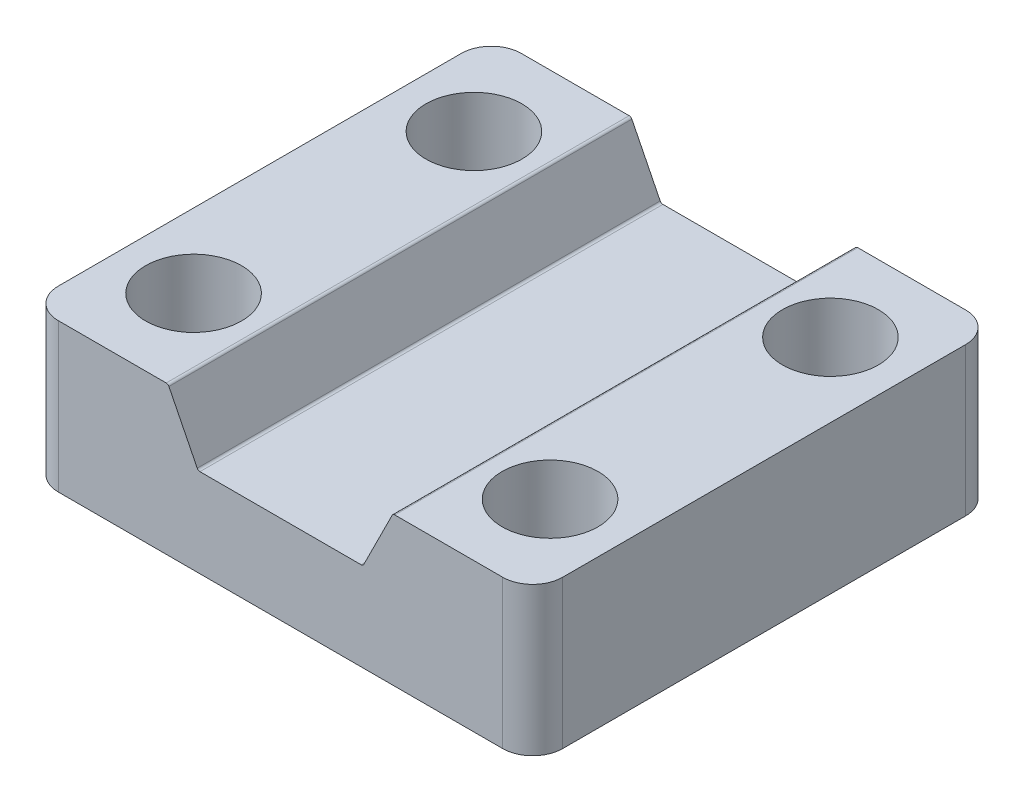
ISO-10303-21;
HEADER;
FILE_DESCRIPTION(('STEP AP214'),'2;1');
FILE_NAME('part.step','',(''),(''),'','','');
FILE_SCHEMA(('AUTOMOTIVE_DESIGN { 1 0 10303 214 1 1 1 1 }'));
ENDSEC;
DATA;
#1=APPLICATION_CONTEXT('core data for automotive mechanical design processes');
#2=APPLICATION_PROTOCOL_DEFINITION('international standard','automotive_design',2000,#1);
#3=PRODUCT_CONTEXT('',#1,'mechanical');
#4=PRODUCT('Part','Part','',(#3));
#5=PRODUCT_RELATED_PRODUCT_CATEGORY('part','',(#4));
#6=PRODUCT_DEFINITION_FORMATION('','',#4);
#7=PRODUCT_DEFINITION_CONTEXT('part definition',#1,'design');
#8=PRODUCT_DEFINITION('design','',#6,#7);
#9=PRODUCT_DEFINITION_SHAPE('','',#8);
#10=(LENGTH_UNIT() NAMED_UNIT(*) SI_UNIT(.MILLI.,.METRE.));
#11=(NAMED_UNIT(*) PLANE_ANGLE_UNIT() SI_UNIT($,.RADIAN.));
#12=(NAMED_UNIT(*) SI_UNIT($,.STERADIAN.) SOLID_ANGLE_UNIT());
#13=UNCERTAINTY_MEASURE_WITH_UNIT(LENGTH_MEASURE(1.E-05),#10,'distance_accuracy_value','');
#14=(GEOMETRIC_REPRESENTATION_CONTEXT(3) GLOBAL_UNCERTAINTY_ASSIGNED_CONTEXT((#13)) GLOBAL_UNIT_ASSIGNED_CONTEXT((#10,
#11,#12)) REPRESENTATION_CONTEXT('',''));
#15=CARTESIAN_POINT('',(0.,0.,0.));
#16=DIRECTION('',(0.,0.,1.));
#17=DIRECTION('',(1.,0.,0.));
#18=AXIS2_PLACEMENT_3D('',#15,#16,#17);
#19=CARTESIAN_POINT('',(6.82801936685753,7.747,-19.6088));
#20=DIRECTION('',(0.,0.,-1.));
#21=DIRECTION('',(-1.,0.,0.));
#22=AXIS2_PLACEMENT_3D('',#19,#20,#21);
#23=CYLINDRICAL_SURFACE('',#22,0.254);
#24=DIRECTION('',(0.,0.,-1.));
#25=VECTOR('',#24,1.);
#26=CARTESIAN_POINT('',(6.82801936685753,7.493,-19.6088));
#27=LINE('',#26,#25);
#28=CARTESIAN_POINT('',(6.82801936685753,7.493,-19.6088));
#29=VERTEX_POINT('',#28);
#30=CARTESIAN_POINT('',(6.82801936685753,7.493,19.6088));
#31=VERTEX_POINT('',#30);
#32=EDGE_CURVE('E147',#29,#31,#27,.F.);
#33=ORIENTED_EDGE('',*,*,#32,.T.);
#34=CARTESIAN_POINT('',(6.82801936685753,7.747,19.6088));
#35=DIRECTION('',(0.,0.,-1.));
#36=DIRECTION('',(-1.,0.,0.));
#37=AXIS2_PLACEMENT_3D('',#34,#35,#36);
#38=CIRCLE('',#37,0.254);
#39=CARTESIAN_POINT('',(7.05520387337151,7.63340774674301,19.6088));
#40=VERTEX_POINT('',#39);
#41=EDGE_CURVE('E24',#40,#31,#38,.T.);
#42=ORIENTED_EDGE('',*,*,#41,.F.);
#43=DIRECTION('',(0.,0.,1.));
#44=VECTOR('',#43,1.);
#45=CARTESIAN_POINT('',(7.05520387337151,7.63340774674301,-19.6088));
#46=LINE('',#45,#44);
#47=CARTESIAN_POINT('',(7.05520387337151,7.63340774674301,-19.6088));
#48=VERTEX_POINT('',#47);
#49=EDGE_CURVE('E410',#40,#48,#46,.F.);
#50=ORIENTED_EDGE('',*,*,#49,.T.);
#51=CARTESIAN_POINT('',(6.82801936685753,7.747,-19.6088));
#52=DIRECTION('',(0.,0.,-1.));
#53=DIRECTION('',(-1.,0.,0.));
#54=AXIS2_PLACEMENT_3D('',#51,#52,#53);
#55=CIRCLE('',#54,0.254);
#56=EDGE_CURVE('E145',#29,#48,#55,.F.);
#57=ORIENTED_EDGE('',*,*,#56,.F.);
#58=EDGE_LOOP('',(#33,#42,#50,#57));
#59=FACE_BOUND('',#58,.T.);
#60=ADVANCED_FACE('F21',(#59),#23,.F.);
#61=CARTESIAN_POINT('',(-6.82801936685753,7.747,-19.6088));
#62=DIRECTION('',(0.,0.,-1.));
#63=DIRECTION('',(-1.,0.,0.));
#64=AXIS2_PLACEMENT_3D('',#61,#62,#63);
#65=CYLINDRICAL_SURFACE('',#64,0.254);
#66=DIRECTION('',(0.,0.,1.));
#67=VECTOR('',#66,1.);
#68=CARTESIAN_POINT('',(-7.05520387337151,7.63340774674301,-19.6088));
#69=LINE('',#68,#67);
#70=CARTESIAN_POINT('',(-7.05520387337151,7.63340774674301,-19.6088));
#71=VERTEX_POINT('',#70);
#72=CARTESIAN_POINT('',(-7.05520387337151,7.63340774674301,19.6088));
#73=VERTEX_POINT('',#72);
#74=EDGE_CURVE('E399',#71,#73,#69,.T.);
#75=ORIENTED_EDGE('',*,*,#74,.T.);
#76=CARTESIAN_POINT('',(-6.82801936685753,7.747,19.6088));
#77=DIRECTION('',(0.,0.,-1.));
#78=DIRECTION('',(-1.,0.,0.));
#79=AXIS2_PLACEMENT_3D('',#76,#77,#78);
#80=CIRCLE('',#79,0.254);
#81=CARTESIAN_POINT('',(-6.82801936685753,7.493,19.6088));
#82=VERTEX_POINT('',#81);
#83=EDGE_CURVE('E466',#82,#73,#80,.T.);
#84=ORIENTED_EDGE('',*,*,#83,.F.);
#85=DIRECTION('',(0.,0.,-1.));
#86=VECTOR('',#85,1.);
#87=CARTESIAN_POINT('',(-6.82801936685753,7.493,-19.6088));
#88=LINE('',#87,#86);
#89=CARTESIAN_POINT('',(-6.82801936685753,7.493,-19.6088));
#90=VERTEX_POINT('',#89);
#91=EDGE_CURVE('E153',#82,#90,#88,.T.);
#92=ORIENTED_EDGE('',*,*,#91,.T.);
#93=CARTESIAN_POINT('',(-6.82801936685753,7.747,-19.6088));
#94=DIRECTION('',(0.,0.,-1.));
#95=DIRECTION('',(-1.,0.,0.));
#96=AXIS2_PLACEMENT_3D('',#93,#94,#95);
#97=CIRCLE('',#96,0.254);
#98=EDGE_CURVE('E467',#71,#90,#97,.F.);
#99=ORIENTED_EDGE('',*,*,#98,.F.);
#100=EDGE_LOOP('',(#75,#84,#92,#99));
#101=FACE_BOUND('',#100,.T.);
#102=ADVANCED_FACE('F458',(#101),#65,.F.);
#103=CARTESIAN_POINT('',(9.68198063314247,12.319,0.));
#104=DIRECTION('',(0.,0.,-1.));
#105=DIRECTION('',(-1.,0.,0.));
#106=AXIS2_PLACEMENT_3D('',#103,#104,#105);
#107=CYLINDRICAL_SURFACE('',#106,0.254000000000001);
#108=CARTESIAN_POINT('',(9.68198063314247,12.319,19.6088));
#109=DIRECTION('',(0.,0.,-1.));
#110=DIRECTION('',(-1.,0.,0.));
#111=AXIS2_PLACEMENT_3D('',#108,#109,#110);
#112=CIRCLE('',#111,0.254000000000001);
#113=CARTESIAN_POINT('',(9.4547961266285,12.432592253257,19.6088));
#114=VERTEX_POINT('',#113);
#115=CARTESIAN_POINT('',(9.68198063314247,12.573,19.6088));
#116=VERTEX_POINT('',#115);
#117=EDGE_CURVE('E231',#114,#116,#112,.T.);
#118=ORIENTED_EDGE('',*,*,#117,.T.);
#119=DIRECTION('',(0.,0.,1.));
#120=VECTOR('',#119,1.);
#121=CARTESIAN_POINT('',(9.68198063314247,12.573,0.));
#122=LINE('',#121,#120);
#123=CARTESIAN_POINT('',(9.68198063314247,12.573,-19.6088));
#124=VERTEX_POINT('',#123);
#125=EDGE_CURVE('E189',#124,#116,#122,.T.);
#126=ORIENTED_EDGE('',*,*,#125,.F.);
#127=CARTESIAN_POINT('',(9.68198063314247,12.319,-19.6088));
#128=DIRECTION('',(0.,0.,-1.));
#129=DIRECTION('',(-1.,0.,0.));
#130=AXIS2_PLACEMENT_3D('',#127,#128,#129);
#131=CIRCLE('',#130,0.254000000000001);
#132=CARTESIAN_POINT('',(9.45479612662849,12.432592253257,-19.6088));
#133=VERTEX_POINT('',#132);
#134=EDGE_CURVE('E235',#124,#133,#131,.F.);
#135=ORIENTED_EDGE('',*,*,#134,.T.);
#136=DIRECTION('',(0.,0.,1.));
#137=VECTOR('',#136,1.);
#138=CARTESIAN_POINT('',(9.45479612662849,12.432592253257,-19.6088));
#139=LINE('',#138,#137);
#140=EDGE_CURVE('E227',#133,#114,#139,.T.);
#141=ORIENTED_EDGE('',*,*,#140,.T.);
#142=EDGE_LOOP('',(#118,#126,#135,#141));
#143=FACE_BOUND('',#142,.T.);
#144=ADVANCED_FACE('F456',(#143),#107,.T.);
#145=CARTESIAN_POINT('',(-9.68198063314247,12.319,-19.6088));
#146=DIRECTION('',(0.,0.,-1.));
#147=DIRECTION('',(-1.,0.,0.));
#148=AXIS2_PLACEMENT_3D('',#145,#146,#147);
#149=CYLINDRICAL_SURFACE('',#148,0.254000000000001);
#150=CARTESIAN_POINT('',(-9.68198063314247,12.319,19.6088));
#151=DIRECTION('',(0.,0.,-1.));
#152=DIRECTION('',(-1.,0.,0.));
#153=AXIS2_PLACEMENT_3D('',#150,#151,#152);
#154=CIRCLE('',#153,0.254000000000001);
#155=CARTESIAN_POINT('',(-9.68198063314247,12.573,19.6088));
#156=VERTEX_POINT('',#155);
#157=CARTESIAN_POINT('',(-9.45479612662849,12.432592253257,19.6088));
#158=VERTEX_POINT('',#157);
#159=EDGE_CURVE('E223',#156,#158,#154,.T.);
#160=ORIENTED_EDGE('',*,*,#159,.T.);
#161=DIRECTION('',(0.,0.,1.));
#162=VECTOR('',#161,1.);
#163=CARTESIAN_POINT('',(-9.45479612662849,12.432592253257,-19.6088));
#164=LINE('',#163,#162);
#165=CARTESIAN_POINT('',(-9.45479612662849,12.432592253257,-19.6088));
#166=VERTEX_POINT('',#165);
#167=EDGE_CURVE('E152',#158,#166,#164,.F.);
#168=ORIENTED_EDGE('',*,*,#167,.T.);
#169=CARTESIAN_POINT('',(-9.68198063314247,12.319,-19.6088));
#170=DIRECTION('',(0.,0.,-1.));
#171=DIRECTION('',(-1.,0.,0.));
#172=AXIS2_PLACEMENT_3D('',#169,#170,#171);
#173=CIRCLE('',#172,0.254000000000001);
#174=CARTESIAN_POINT('',(-9.68198063314247,12.573,-19.6088));
#175=VERTEX_POINT('',#174);
#176=EDGE_CURVE('E228',#166,#175,#173,.F.);
#177=ORIENTED_EDGE('',*,*,#176,.T.);
#178=DIRECTION('',(0.,0.,1.));
#179=VECTOR('',#178,1.);
#180=CARTESIAN_POINT('',(-9.68198063314247,12.573,0.));
#181=LINE('',#180,#179);
#182=EDGE_CURVE('E222',#156,#175,#181,.F.);
#183=ORIENTED_EDGE('',*,*,#182,.F.);
#184=EDGE_LOOP('',(#160,#168,#177,#183));
#185=FACE_BOUND('',#184,.T.);
#186=ADVANCED_FACE('F452',(#185),#149,.T.);
#187=CARTESIAN_POINT('',(6.985,7.493,-19.6088));
#188=DIRECTION('',(0.894427190999916,-0.447213595499958,0.));
#189=DIRECTION('',(0.447213595499958,0.894427190999916,0.));
#190=AXIS2_PLACEMENT_3D('',#187,#188,#189);
#191=PLANE('',#190);
#192=ORIENTED_EDGE('',*,*,#49,.F.);
#193=DIRECTION('',(0.447213595499958,0.894427190999916,0.));
#194=VECTOR('',#193,1.);
#195=CARTESIAN_POINT('',(7.05520387337151,7.63340774674301,19.6088));
#196=LINE('',#195,#194);
#197=EDGE_CURVE('E143',#40,#114,#196,.T.);
#198=ORIENTED_EDGE('',*,*,#197,.T.);
#199=ORIENTED_EDGE('',*,*,#140,.F.);
#200=DIRECTION('',(-0.447213595499958,-0.894427190999916,0.));
#201=VECTOR('',#200,1.);
#202=CARTESIAN_POINT('',(9.45479612662849,12.432592253257,-19.6088));
#203=LINE('',#202,#201);
#204=EDGE_CURVE('E365',#133,#48,#203,.T.);
#205=ORIENTED_EDGE('',*,*,#204,.T.);
#206=EDGE_LOOP('',(#192,#198,#199,#205));
#207=FACE_BOUND('',#206,.T.);
#208=ADVANCED_FACE('F449',(#207),#191,.F.);
#209=CARTESIAN_POINT('',(-6.985,7.493,-19.6088));
#210=DIRECTION('',(0.,-1.,0.));
#211=DIRECTION('',(0.,0.,-1.));
#212=AXIS2_PLACEMENT_3D('',#209,#210,#211);
#213=PLANE('',#212);
#214=ORIENTED_EDGE('',*,*,#32,.F.);
#215=DIRECTION('',(1.,0.,0.));
#216=VECTOR('',#215,1.);
#217=CARTESIAN_POINT('',(-21.3614,7.493,-19.6088));
#218=LINE('',#217,#216);
#219=EDGE_CURVE('E362',#29,#90,#218,.F.);
#220=ORIENTED_EDGE('',*,*,#219,.T.);
#221=ORIENTED_EDGE('',*,*,#91,.F.);
#222=DIRECTION('',(-1.,0.,0.));
#223=VECTOR('',#222,1.);
#224=CARTESIAN_POINT('',(-21.3614,7.493,19.6088));
#225=LINE('',#224,#223);
#226=EDGE_CURVE('E141',#82,#31,#225,.F.);
#227=ORIENTED_EDGE('',*,*,#226,.T.);
#228=EDGE_LOOP('',(#214,#220,#221,#227));
#229=FACE_BOUND('',#228,.T.);
#230=ADVANCED_FACE('F156',(#229),#213,.F.);
#231=CARTESIAN_POINT('',(-9.525,12.573,-19.6088));
#232=DIRECTION('',(-0.894427190999916,-0.447213595499958,0.));
#233=DIRECTION('',(0.447213595499958,-0.894427190999916,0.));
#234=AXIS2_PLACEMENT_3D('',#231,#232,#233);
#235=PLANE('',#234);
#236=ORIENTED_EDGE('',*,*,#74,.F.);
#237=DIRECTION('',(-0.447213595499958,0.894427190999916,0.));
#238=VECTOR('',#237,1.);
#239=CARTESIAN_POINT('',(-7.05520387337151,7.63340774674301,-19.6088));
#240=LINE('',#239,#238);
#241=EDGE_CURVE('E358',#71,#166,#240,.T.);
#242=ORIENTED_EDGE('',*,*,#241,.T.);
#243=ORIENTED_EDGE('',*,*,#167,.F.);
#244=DIRECTION('',(0.447213595499958,-0.894427190999916,0.));
#245=VECTOR('',#244,1.);
#246=CARTESIAN_POINT('',(-9.45479612662849,12.432592253257,19.6088));
#247=LINE('',#246,#245);
#248=EDGE_CURVE('E159',#158,#73,#247,.T.);
#249=ORIENTED_EDGE('',*,*,#248,.T.);
#250=EDGE_LOOP('',(#236,#242,#243,#249));
#251=FACE_BOUND('',#250,.T.);
#252=ADVANCED_FACE('F443',(#251),#235,.F.);
#253=CARTESIAN_POINT('',(0.,12.573,0.));
#254=DIRECTION('',(0.,1.,0.));
#255=DIRECTION('',(0.,0.,1.));
#256=AXIS2_PLACEMENT_3D('',#253,#254,#255);
#257=PLANE('',#256);
#258=CARTESIAN_POINT('',(15.1003,12.573,-11.8745));
#259=DIRECTION('',(0.,-1.,0.));
#260=DIRECTION('',(0.,0.,-1.));
#261=AXIS2_PLACEMENT_3D('',#258,#259,#260);
#262=CIRCLE('',#261,4.06400000000002);
#263=CARTESIAN_POINT('',(15.1003,12.573,-15.9385));
#264=VERTEX_POINT('',#263);
#265=EDGE_CURVE('E275',#264,#264,#262,.T.);
#266=ORIENTED_EDGE('',*,*,#265,.T.);
#267=EDGE_LOOP('',(#266));
#268=FACE_BOUND('',#267,.T.);
#269=CARTESIAN_POINT('',(15.1003,12.573,11.8745));
#270=DIRECTION('',(0.,-1.,0.));
#271=DIRECTION('',(0.,0.,-1.));
#272=AXIS2_PLACEMENT_3D('',#269,#270,#271);
#273=CIRCLE('',#272,4.06400000000002);
#274=CARTESIAN_POINT('',(15.1003,12.573,7.81049999999998));
#275=VERTEX_POINT('',#274);
#276=EDGE_CURVE('E280',#275,#275,#273,.T.);
#277=ORIENTED_EDGE('',*,*,#276,.T.);
#278=EDGE_LOOP('',(#277));
#279=FACE_BOUND('',#278,.T.);
#280=DIRECTION('',(-1.,0.,0.));
#281=VECTOR('',#280,1.);
#282=CARTESIAN_POINT('',(-21.3614,12.573,19.6088));
#283=LINE('',#282,#281);
#284=CARTESIAN_POINT('',(18.8214,12.573,19.6088));
#285=VERTEX_POINT('',#284);
#286=EDGE_CURVE('E164',#116,#285,#283,.F.);
#287=ORIENTED_EDGE('',*,*,#286,.T.);
#288=CARTESIAN_POINT('',(18.8214,12.573,17.0688));
#289=DIRECTION('',(0.,-1.,0.));
#290=DIRECTION('',(0.,0.,-1.));
#291=AXIS2_PLACEMENT_3D('',#288,#289,#290);
#292=CIRCLE('',#291,2.54);
#293=CARTESIAN_POINT('',(21.3614,12.573,17.0688));
#294=VERTEX_POINT('',#293);
#295=EDGE_CURVE('E205',#294,#285,#292,.T.);
#296=ORIENTED_EDGE('',*,*,#295,.F.);
#297=DIRECTION('',(0.,0.,1.));
#298=VECTOR('',#297,1.);
#299=CARTESIAN_POINT('',(21.3614,12.573,-19.6088));
#300=LINE('',#299,#298);
#301=CARTESIAN_POINT('',(21.3614,12.573,-17.0688));
#302=VERTEX_POINT('',#301);
#303=EDGE_CURVE('E415',#294,#302,#300,.F.);
#304=ORIENTED_EDGE('',*,*,#303,.T.);
#305=CARTESIAN_POINT('',(18.8214,12.573,-17.0688));
#306=DIRECTION('',(0.,-1.,0.));
#307=DIRECTION('',(0.,0.,-1.));
#308=AXIS2_PLACEMENT_3D('',#305,#306,#307);
#309=CIRCLE('',#308,2.54);
#310=CARTESIAN_POINT('',(18.8214,12.573,-19.6088));
#311=VERTEX_POINT('',#310);
#312=EDGE_CURVE('E217',#311,#302,#309,.T.);
#313=ORIENTED_EDGE('',*,*,#312,.F.);
#314=DIRECTION('',(1.,0.,0.));
#315=VECTOR('',#314,1.);
#316=CARTESIAN_POINT('',(-21.3614,12.573,-19.6088));
#317=LINE('',#316,#315);
#318=EDGE_CURVE('E285',#311,#124,#317,.F.);
#319=ORIENTED_EDGE('',*,*,#318,.T.);
#320=ORIENTED_EDGE('',*,*,#125,.T.);
#321=EDGE_LOOP('',(#287,#296,#304,#313,#319,#320));
#322=FACE_BOUND('',#321,.T.);
#323=ADVANCED_FACE('F295',(#268,#279,#322),#257,.T.);
#324=CARTESIAN_POINT('',(0.,12.573,0.));
#325=DIRECTION('',(0.,1.,0.));
#326=DIRECTION('',(0.,0.,1.));
#327=AXIS2_PLACEMENT_3D('',#324,#325,#326);
#328=PLANE('',#327);
#329=CARTESIAN_POINT('',(-15.1003,12.573,11.8745));
#330=DIRECTION('',(0.,-1.,0.));
#331=DIRECTION('',(0.,0.,-1.));
#332=AXIS2_PLACEMENT_3D('',#329,#330,#331);
#333=CIRCLE('',#332,4.06400000000002);
#334=CARTESIAN_POINT('',(-15.1003,12.573,7.81049999999998));
#335=VERTEX_POINT('',#334);
#336=EDGE_CURVE('E270',#335,#335,#333,.T.);
#337=ORIENTED_EDGE('',*,*,#336,.T.);
#338=EDGE_LOOP('',(#337));
#339=FACE_BOUND('',#338,.T.);
#340=CARTESIAN_POINT('',(-15.1003,12.573,-11.8745));
#341=DIRECTION('',(0.,-1.,0.));
#342=DIRECTION('',(0.,0.,-1.));
#343=AXIS2_PLACEMENT_3D('',#340,#341,#342);
#344=CIRCLE('',#343,4.06400000000002);
#345=CARTESIAN_POINT('',(-15.1003,12.573,-15.9385));
#346=VERTEX_POINT('',#345);
#347=EDGE_CURVE('E284',#346,#346,#344,.T.);
#348=ORIENTED_EDGE('',*,*,#347,.T.);
#349=EDGE_LOOP('',(#348));
#350=FACE_BOUND('',#349,.T.);
#351=DIRECTION('',(-1.,0.,0.));
#352=VECTOR('',#351,1.);
#353=CARTESIAN_POINT('',(-21.3614,12.573,19.6088));
#354=LINE('',#353,#352);
#355=CARTESIAN_POINT('',(-18.8214,12.573,19.6088));
#356=VERTEX_POINT('',#355);
#357=EDGE_CURVE('E167',#356,#156,#354,.F.);
#358=ORIENTED_EDGE('',*,*,#357,.T.);
#359=ORIENTED_EDGE('',*,*,#182,.T.);
#360=DIRECTION('',(1.,0.,0.));
#361=VECTOR('',#360,1.);
#362=CARTESIAN_POINT('',(-21.3614,12.573,-19.6088));
#363=LINE('',#362,#361);
#364=CARTESIAN_POINT('',(-18.8214,12.573,-19.6088));
#365=VERTEX_POINT('',#364);
#366=EDGE_CURVE('E353',#175,#365,#363,.F.);
#367=ORIENTED_EDGE('',*,*,#366,.T.);
#368=CARTESIAN_POINT('',(-18.8214,12.573,-17.0688));
#369=DIRECTION('',(0.,-1.,0.));
#370=DIRECTION('',(0.,0.,-1.));
#371=AXIS2_PLACEMENT_3D('',#368,#369,#370);
#372=CIRCLE('',#371,2.54);
#373=CARTESIAN_POINT('',(-21.3614,12.573,-17.0688));
#374=VERTEX_POINT('',#373);
#375=EDGE_CURVE('E188',#374,#365,#372,.T.);
#376=ORIENTED_EDGE('',*,*,#375,.F.);
#377=DIRECTION('',(0.,0.,-1.));
#378=VECTOR('',#377,1.);
#379=CARTESIAN_POINT('',(-21.3614,12.573,-19.6088));
#380=LINE('',#379,#378);
#381=CARTESIAN_POINT('',(-21.3614,12.573,17.0688));
#382=VERTEX_POINT('',#381);
#383=EDGE_CURVE('E187',#374,#382,#380,.F.);
#384=ORIENTED_EDGE('',*,*,#383,.T.);
#385=CARTESIAN_POINT('',(-18.8214,12.573,17.0688));
#386=DIRECTION('',(0.,-1.,0.));
#387=DIRECTION('',(0.,0.,-1.));
#388=AXIS2_PLACEMENT_3D('',#385,#386,#387);
#389=CIRCLE('',#388,2.54);
#390=EDGE_CURVE('E181',#356,#382,#389,.T.);
#391=ORIENTED_EDGE('',*,*,#390,.F.);
#392=EDGE_LOOP('',(#358,#359,#367,#376,#384,#391));
#393=FACE_BOUND('',#392,.T.);
#394=ADVANCED_FACE('F391',(#339,#350,#393),#328,.T.);
#395=CARTESIAN_POINT('',(-18.8214,12.573,-17.0688));
#396=DIRECTION('',(0.,-1.,0.));
#397=DIRECTION('',(0.,0.,-1.));
#398=AXIS2_PLACEMENT_3D('',#395,#396,#397);
#399=CYLINDRICAL_SURFACE('',#398,2.54);
#400=CARTESIAN_POINT('',(-18.8214,0.,-17.0688));
#401=DIRECTION('',(0.,-1.,0.));
#402=DIRECTION('',(0.,0.,-1.));
#403=AXIS2_PLACEMENT_3D('',#400,#401,#402);
#404=CIRCLE('',#403,2.54);
#405=CARTESIAN_POINT('',(-18.8214,0.,-19.6088));
#406=VERTEX_POINT('',#405);
#407=CARTESIAN_POINT('',(-21.3614,0.,-17.0688));
#408=VERTEX_POINT('',#407);
#409=EDGE_CURVE('E266',#406,#408,#404,.F.);
#410=ORIENTED_EDGE('',*,*,#409,.T.);
#411=DIRECTION('',(0.,1.,0.));
#412=VECTOR('',#411,1.);
#413=CARTESIAN_POINT('',(-21.3614,12.573,-17.0688));
#414=LINE('',#413,#412);
#415=EDGE_CURVE('E182',#408,#374,#414,.T.);
#416=ORIENTED_EDGE('',*,*,#415,.T.);
#417=ORIENTED_EDGE('',*,*,#375,.T.);
#418=DIRECTION('',(0.,1.,0.));
#419=VECTOR('',#418,1.);
#420=CARTESIAN_POINT('',(-18.8214,12.573,-19.6088));
#421=LINE('',#420,#419);
#422=EDGE_CURVE('E357',#365,#406,#421,.F.);
#423=ORIENTED_EDGE('',*,*,#422,.T.);
#424=EDGE_LOOP('',(#410,#416,#417,#423));
#425=FACE_BOUND('',#424,.T.);
#426=ADVANCED_FACE('F429',(#425),#399,.T.);
#427=CARTESIAN_POINT('',(-21.3614,12.573,-19.6088));
#428=DIRECTION('',(1.,0.,0.));
#429=DIRECTION('',(0.,0.,-1.));
#430=AXIS2_PLACEMENT_3D('',#427,#428,#429);
#431=PLANE('',#430);
#432=ORIENTED_EDGE('',*,*,#415,.F.);
#433=DIRECTION('',(0.,0.,1.));
#434=VECTOR('',#433,1.);
#435=CARTESIAN_POINT('',(-21.3614,0.,0.));
#436=LINE('',#435,#434);
#437=CARTESIAN_POINT('',(-21.3614,0.,17.0688));
#438=VERTEX_POINT('',#437);
#439=EDGE_CURVE('E265',#408,#438,#436,.T.);
#440=ORIENTED_EDGE('',*,*,#439,.T.);
#441=DIRECTION('',(0.,-1.,0.));
#442=VECTOR('',#441,1.);
#443=CARTESIAN_POINT('',(-21.3614,12.573,17.0688));
#444=LINE('',#443,#442);
#445=EDGE_CURVE('E178',#382,#438,#444,.T.);
#446=ORIENTED_EDGE('',*,*,#445,.F.);
#447=ORIENTED_EDGE('',*,*,#383,.F.);
#448=EDGE_LOOP('',(#432,#440,#446,#447));
#449=FACE_BOUND('',#448,.T.);
#450=ADVANCED_FACE('F428',(#449),#431,.F.);
#451=CARTESIAN_POINT('',(-18.8214,12.573,17.0688));
#452=DIRECTION('',(0.,-1.,0.));
#453=DIRECTION('',(0.,0.,-1.));
#454=AXIS2_PLACEMENT_3D('',#451,#452,#453);
#455=CYLINDRICAL_SURFACE('',#454,2.54);
#456=CARTESIAN_POINT('',(-18.8214,0.,17.0688));
#457=DIRECTION('',(0.,-1.,0.));
#458=DIRECTION('',(0.,0.,-1.));
#459=AXIS2_PLACEMENT_3D('',#456,#457,#458);
#460=CIRCLE('',#459,2.54);
#461=CARTESIAN_POINT('',(-18.8214,0.,19.6088));
#462=VERTEX_POINT('',#461);
#463=EDGE_CURVE('E261',#438,#462,#460,.F.);
#464=ORIENTED_EDGE('',*,*,#463,.T.);
#465=DIRECTION('',(0.,1.,0.));
#466=VECTOR('',#465,1.);
#467=CARTESIAN_POINT('',(-18.8214,12.573,19.6088));
#468=LINE('',#467,#466);
#469=EDGE_CURVE('E174',#462,#356,#468,.T.);
#470=ORIENTED_EDGE('',*,*,#469,.T.);
#471=ORIENTED_EDGE('',*,*,#390,.T.);
#472=ORIENTED_EDGE('',*,*,#445,.T.);
#473=EDGE_LOOP('',(#464,#470,#471,#472));
#474=FACE_BOUND('',#473,.T.);
#475=ADVANCED_FACE('F424',(#474),#455,.T.);
#476=CARTESIAN_POINT('',(-21.3614,12.573,19.6088));
#477=DIRECTION('',(0.,0.,-1.));
#478=DIRECTION('',(-1.,0.,0.));
#479=AXIS2_PLACEMENT_3D('',#476,#477,#478);
#480=PLANE('',#479);
#481=DIRECTION('',(0.,-1.,0.));
#482=VECTOR('',#481,1.);
#483=CARTESIAN_POINT('',(18.8214,12.573,19.6088));
#484=LINE('',#483,#482);
#485=CARTESIAN_POINT('',(18.8214,0.,19.6088));
#486=VERTEX_POINT('',#485);
#487=EDGE_CURVE('E200',#285,#486,#484,.T.);
#488=ORIENTED_EDGE('',*,*,#487,.F.);
#489=ORIENTED_EDGE('',*,*,#286,.F.);
#490=ORIENTED_EDGE('',*,*,#117,.F.);
#491=ORIENTED_EDGE('',*,*,#197,.F.);
#492=ORIENTED_EDGE('',*,*,#41,.T.);
#493=ORIENTED_EDGE('',*,*,#226,.F.);
#494=ORIENTED_EDGE('',*,*,#83,.T.);
#495=ORIENTED_EDGE('',*,*,#248,.F.);
#496=ORIENTED_EDGE('',*,*,#159,.F.);
#497=ORIENTED_EDGE('',*,*,#357,.F.);
#498=ORIENTED_EDGE('',*,*,#469,.F.);
#499=DIRECTION('',(1.,0.,0.));
#500=VECTOR('',#499,1.);
#501=CARTESIAN_POINT('',(0.,0.,19.6088));
#502=LINE('',#501,#500);
#503=EDGE_CURVE('E260',#462,#486,#502,.T.);
#504=ORIENTED_EDGE('',*,*,#503,.T.);
#505=EDGE_LOOP('',(#488,#489,#490,#491,#492,#493,#494,#495,#496,#497,#498,#504));
#506=FACE_BOUND('',#505,.T.);
#507=ADVANCED_FACE('F139',(#506),#480,.F.);
#508=CARTESIAN_POINT('',(18.8214,12.573,17.0688));
#509=DIRECTION('',(0.,-1.,0.));
#510=DIRECTION('',(0.,0.,-1.));
#511=AXIS2_PLACEMENT_3D('',#508,#509,#510);
#512=CYLINDRICAL_SURFACE('',#511,2.54);
#513=CARTESIAN_POINT('',(18.8214,0.,17.0688));
#514=DIRECTION('',(0.,-1.,0.));
#515=DIRECTION('',(0.,0.,-1.));
#516=AXIS2_PLACEMENT_3D('',#513,#514,#515);
#517=CIRCLE('',#516,2.54);
#518=CARTESIAN_POINT('',(21.3614,0.,17.0688));
#519=VERTEX_POINT('',#518);
#520=EDGE_CURVE('E256',#486,#519,#517,.F.);
#521=ORIENTED_EDGE('',*,*,#520,.T.);
#522=DIRECTION('',(0.,1.,0.));
#523=VECTOR('',#522,1.);
#524=CARTESIAN_POINT('',(21.3614,12.573,17.0688));
#525=LINE('',#524,#523);
#526=EDGE_CURVE('E204',#519,#294,#525,.T.);
#527=ORIENTED_EDGE('',*,*,#526,.T.);
#528=ORIENTED_EDGE('',*,*,#295,.T.);
#529=ORIENTED_EDGE('',*,*,#487,.T.);
#530=EDGE_LOOP('',(#521,#527,#528,#529));
#531=FACE_BOUND('',#530,.T.);
#532=ADVANCED_FACE('F420',(#531),#512,.T.);
#533=CARTESIAN_POINT('',(21.3614,12.573,-19.6088));
#534=DIRECTION('',(-1.,0.,0.));
#535=DIRECTION('',(0.,0.,1.));
#536=AXIS2_PLACEMENT_3D('',#533,#534,#535);
#537=PLANE('',#536);
#538=DIRECTION('',(0.,-1.,0.));
#539=VECTOR('',#538,1.);
#540=CARTESIAN_POINT('',(21.3614,12.573,-17.0688));
#541=LINE('',#540,#539);
#542=CARTESIAN_POINT('',(21.3614,0.,-17.0688));
#543=VERTEX_POINT('',#542);
#544=EDGE_CURVE('E339',#302,#543,#541,.T.);
#545=ORIENTED_EDGE('',*,*,#544,.F.);
#546=ORIENTED_EDGE('',*,*,#303,.F.);
#547=ORIENTED_EDGE('',*,*,#526,.F.);
#548=DIRECTION('',(0.,0.,1.));
#549=VECTOR('',#548,1.);
#550=CARTESIAN_POINT('',(21.3614,0.,0.));
#551=LINE('',#550,#549);
#552=EDGE_CURVE('E255',#519,#543,#551,.F.);
#553=ORIENTED_EDGE('',*,*,#552,.T.);
#554=EDGE_LOOP('',(#545,#546,#547,#553));
#555=FACE_BOUND('',#554,.T.);
#556=ADVANCED_FACE('F337',(#555),#537,.F.);
#557=CARTESIAN_POINT('',(18.8214,12.573,-17.0688));
#558=DIRECTION('',(0.,-1.,0.));
#559=DIRECTION('',(0.,0.,-1.));
#560=AXIS2_PLACEMENT_3D('',#557,#558,#559);
#561=CYLINDRICAL_SURFACE('',#560,2.54);
#562=CARTESIAN_POINT('',(18.8214,0.,-17.0688));
#563=DIRECTION('',(0.,-1.,0.));
#564=DIRECTION('',(0.,0.,-1.));
#565=AXIS2_PLACEMENT_3D('',#562,#563,#564);
#566=CIRCLE('',#565,2.54);
#567=CARTESIAN_POINT('',(18.8214,0.,-19.6088));
#568=VERTEX_POINT('',#567);
#569=EDGE_CURVE('E251',#543,#568,#566,.F.);
#570=ORIENTED_EDGE('',*,*,#569,.T.);
#571=DIRECTION('',(0.,1.,0.));
#572=VECTOR('',#571,1.);
#573=CARTESIAN_POINT('',(18.8214,12.573,-19.6088));
#574=LINE('',#573,#572);
#575=EDGE_CURVE('E40',#568,#311,#574,.T.);
#576=ORIENTED_EDGE('',*,*,#575,.T.);
#577=ORIENTED_EDGE('',*,*,#312,.T.);
#578=ORIENTED_EDGE('',*,*,#544,.T.);
#579=EDGE_LOOP('',(#570,#576,#577,#578));
#580=FACE_BOUND('',#579,.T.);
#581=ADVANCED_FACE('F479',(#580),#561,.T.);
#582=CARTESIAN_POINT('',(-21.3614,12.573,-19.6088));
#583=DIRECTION('',(0.,0.,1.));
#584=DIRECTION('',(1.,0.,0.));
#585=AXIS2_PLACEMENT_3D('',#582,#583,#584);
#586=PLANE('',#585);
#587=ORIENTED_EDGE('',*,*,#575,.F.);
#588=DIRECTION('',(1.,0.,0.));
#589=VECTOR('',#588,1.);
#590=CARTESIAN_POINT('',(0.,0.,-19.6088));
#591=LINE('',#590,#589);
#592=EDGE_CURVE('E248',#568,#406,#591,.F.);
#593=ORIENTED_EDGE('',*,*,#592,.T.);
#594=ORIENTED_EDGE('',*,*,#422,.F.);
#595=ORIENTED_EDGE('',*,*,#366,.F.);
#596=ORIENTED_EDGE('',*,*,#176,.F.);
#597=ORIENTED_EDGE('',*,*,#241,.F.);
#598=ORIENTED_EDGE('',*,*,#98,.T.);
#599=ORIENTED_EDGE('',*,*,#219,.F.);
#600=ORIENTED_EDGE('',*,*,#56,.T.);
#601=ORIENTED_EDGE('',*,*,#204,.F.);
#602=ORIENTED_EDGE('',*,*,#134,.F.);
#603=ORIENTED_EDGE('',*,*,#318,.F.);
#604=EDGE_LOOP('',(#587,#593,#594,#595,#596,#597,#598,#599,#600,#601,#602,#603));
#605=FACE_BOUND('',#604,.T.);
#606=ADVANCED_FACE('F384',(#605),#586,.F.);
#607=CARTESIAN_POINT('',(15.1003,12.573,11.8745));
#608=DIRECTION('',(0.,-1.,0.));
#609=DIRECTION('',(0.,0.,-1.));
#610=AXIS2_PLACEMENT_3D('',#607,#608,#609);
#611=CYLINDRICAL_SURFACE('',#610,4.06400000000002);
#612=CARTESIAN_POINT('',(15.1003,0.,11.8745));
#613=DIRECTION('',(0.,-1.,0.));
#614=DIRECTION('',(0.,0.,-1.));
#615=AXIS2_PLACEMENT_3D('',#612,#613,#614);
#616=CIRCLE('',#615,4.06400000000002);
#617=CARTESIAN_POINT('',(15.1003,0.,7.81049999999998));
#618=VERTEX_POINT('',#617);
#619=EDGE_CURVE('E242',#618,#618,#616,.T.);
#620=ORIENTED_EDGE('',*,*,#619,.T.);
#621=EDGE_LOOP('',(#620));
#622=FACE_BOUND('',#621,.T.);
#623=ORIENTED_EDGE('',*,*,#276,.F.);
#624=EDGE_LOOP('',(#623));
#625=FACE_BOUND('',#624,.T.);
#626=ADVANCED_FACE('F312',(#622,#625),#611,.F.);
#627=CARTESIAN_POINT('',(-15.1003,12.573,-11.8745));
#628=DIRECTION('',(0.,-1.,0.));
#629=DIRECTION('',(0.,0.,-1.));
#630=AXIS2_PLACEMENT_3D('',#627,#628,#629);
#631=CYLINDRICAL_SURFACE('',#630,4.06400000000002);
#632=CARTESIAN_POINT('',(-15.1003,0.,-11.8745));
#633=DIRECTION('',(0.,-1.,0.));
#634=DIRECTION('',(0.,0.,-1.));
#635=AXIS2_PLACEMENT_3D('',#632,#633,#634);
#636=CIRCLE('',#635,4.06400000000002);
#637=CARTESIAN_POINT('',(-15.1003,0.,-15.9385));
#638=VERTEX_POINT('',#637);
#639=EDGE_CURVE('E247',#638,#638,#636,.T.);
#640=ORIENTED_EDGE('',*,*,#639,.T.);
#641=EDGE_LOOP('',(#640));
#642=FACE_BOUND('',#641,.T.);
#643=ORIENTED_EDGE('',*,*,#347,.F.);
#644=EDGE_LOOP('',(#643));
#645=FACE_BOUND('',#644,.T.);
#646=ADVANCED_FACE('F301',(#642,#645),#631,.F.);
#647=CARTESIAN_POINT('',(15.1003,12.573,-11.8745));
#648=DIRECTION('',(0.,-1.,0.));
#649=DIRECTION('',(0.,0.,-1.));
#650=AXIS2_PLACEMENT_3D('',#647,#648,#649);
#651=CYLINDRICAL_SURFACE('',#650,4.06400000000002);
#652=CARTESIAN_POINT('',(15.1003,0.,-11.8745));
#653=DIRECTION('',(0.,-1.,0.));
#654=DIRECTION('',(0.,0.,-1.));
#655=AXIS2_PLACEMENT_3D('',#652,#653,#654);
#656=CIRCLE('',#655,4.06400000000002);
#657=CARTESIAN_POINT('',(15.1003,0.,-15.9385));
#658=VERTEX_POINT('',#657);
#659=EDGE_CURVE('E31',#658,#658,#656,.T.);
#660=ORIENTED_EDGE('',*,*,#659,.T.);
#661=EDGE_LOOP('',(#660));
#662=FACE_BOUND('',#661,.T.);
#663=ORIENTED_EDGE('',*,*,#265,.F.);
#664=EDGE_LOOP('',(#663));
#665=FACE_BOUND('',#664,.T.);
#666=ADVANCED_FACE('F298',(#662,#665),#651,.F.);
#667=CARTESIAN_POINT('',(-15.1003,12.573,11.8745));
#668=DIRECTION('',(0.,-1.,0.));
#669=DIRECTION('',(0.,0.,-1.));
#670=AXIS2_PLACEMENT_3D('',#667,#668,#669);
#671=CYLINDRICAL_SURFACE('',#670,4.06400000000002);
#672=CARTESIAN_POINT('',(-15.1003,0.,11.8745));
#673=DIRECTION('',(0.,-1.,0.));
#674=DIRECTION('',(0.,0.,-1.));
#675=AXIS2_PLACEMENT_3D('',#672,#673,#674);
#676=CIRCLE('',#675,4.06400000000002);
#677=CARTESIAN_POINT('',(-15.1003,0.,7.81049999999998));
#678=VERTEX_POINT('',#677);
#679=EDGE_CURVE('E12',#678,#678,#676,.T.);
#680=ORIENTED_EDGE('',*,*,#679,.T.);
#681=EDGE_LOOP('',(#680));
#682=FACE_BOUND('',#681,.T.);
#683=ORIENTED_EDGE('',*,*,#336,.F.);
#684=EDGE_LOOP('',(#683));
#685=FACE_BOUND('',#684,.T.);
#686=ADVANCED_FACE('F300',(#682,#685),#671,.F.);
#687=CARTESIAN_POINT('',(0.,0.,0.));
#688=DIRECTION('',(0.,1.,0.));
#689=DIRECTION('',(0.,0.,1.));
#690=AXIS2_PLACEMENT_3D('',#687,#688,#689);
#691=PLANE('',#690);
#692=ORIENTED_EDGE('',*,*,#679,.F.);
#693=EDGE_LOOP('',(#692));
#694=FACE_BOUND('',#693,.T.);
#695=ORIENTED_EDGE('',*,*,#659,.F.);
#696=EDGE_LOOP('',(#695));
#697=FACE_BOUND('',#696,.T.);
#698=ORIENTED_EDGE('',*,*,#639,.F.);
#699=EDGE_LOOP('',(#698));
#700=FACE_BOUND('',#699,.T.);
#701=ORIENTED_EDGE('',*,*,#619,.F.);
#702=EDGE_LOOP('',(#701));
#703=FACE_BOUND('',#702,.T.);
#704=ORIENTED_EDGE('',*,*,#569,.F.);
#705=ORIENTED_EDGE('',*,*,#552,.F.);
#706=ORIENTED_EDGE('',*,*,#520,.F.);
#707=ORIENTED_EDGE('',*,*,#503,.F.);
#708=ORIENTED_EDGE('',*,*,#463,.F.);
#709=ORIENTED_EDGE('',*,*,#439,.F.);
#710=ORIENTED_EDGE('',*,*,#409,.F.);
#711=ORIENTED_EDGE('',*,*,#592,.F.);
#712=EDGE_LOOP('',(#704,#705,#706,#707,#708,#709,#710,#711));
#713=FACE_BOUND('',#712,.T.);
#714=ADVANCED_FACE('F309',(#694,#697,#700,#703,#713),#691,.F.);
#715=CLOSED_SHELL('',(#60,#102,#144,#186,#208,#230,#252,#323,#394,#426,#450,#475,#507,#532,#556,
#581,#606,#626,#646,#666,#686,#714));
#716=MANIFOLD_SOLID_BREP('B1',#715);
#717=ADVANCED_BREP_SHAPE_REPRESENTATION('',(#18,#716),#14);
#718=SHAPE_DEFINITION_REPRESENTATION(#9,#717);
ENDSEC;
END-ISO-10303-21;
